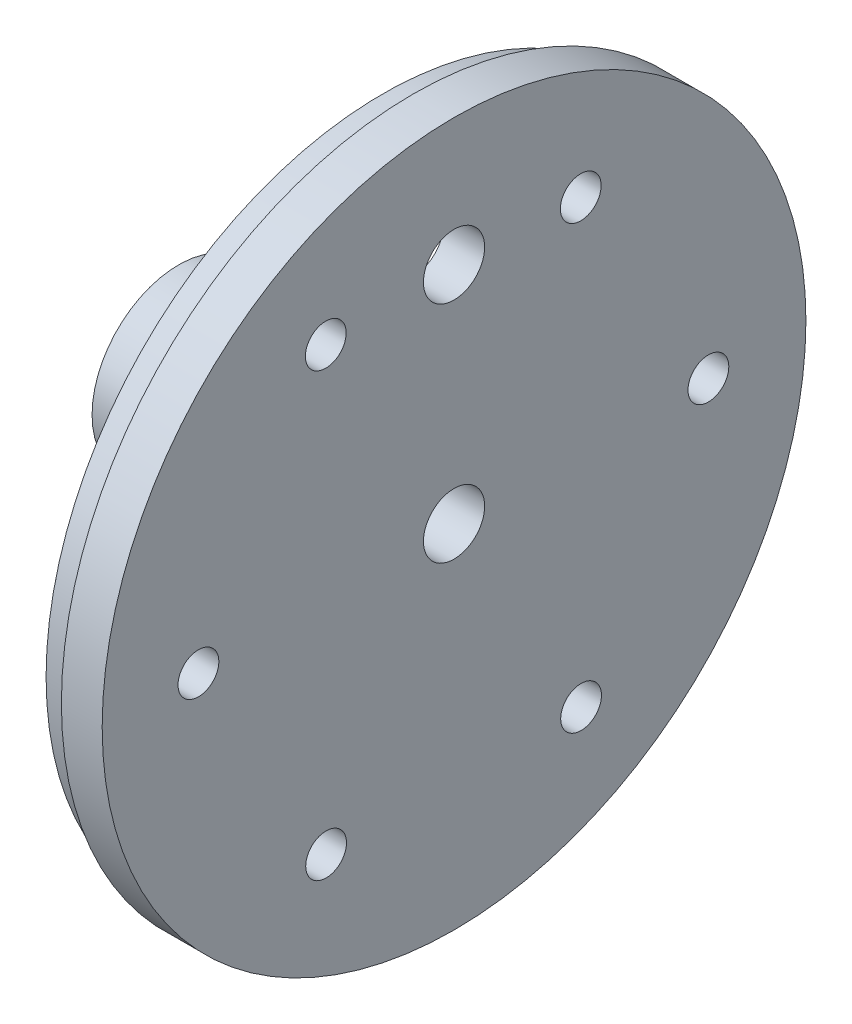
ISO-10303-21;
HEADER;
FILE_DESCRIPTION(('STEP AP214'),'2;1');
FILE_NAME('part.step','',(''),(''),'','','');
FILE_SCHEMA(('AUTOMOTIVE_DESIGN { 1 0 10303 214 1 1 1 1 }'));
ENDSEC;
DATA;
#1=APPLICATION_CONTEXT('core data for automotive mechanical design processes');
#2=APPLICATION_PROTOCOL_DEFINITION('international standard','automotive_design',2000,#1);
#3=PRODUCT_CONTEXT('',#1,'mechanical');
#4=PRODUCT('Part','Part','',(#3));
#5=PRODUCT_RELATED_PRODUCT_CATEGORY('part','',(#4));
#6=PRODUCT_DEFINITION_FORMATION('','',#4);
#7=PRODUCT_DEFINITION_CONTEXT('part definition',#1,'design');
#8=PRODUCT_DEFINITION('design','',#6,#7);
#9=PRODUCT_DEFINITION_SHAPE('','',#8);
#10=(LENGTH_UNIT() NAMED_UNIT(*) SI_UNIT(.MILLI.,.METRE.));
#11=(NAMED_UNIT(*) PLANE_ANGLE_UNIT() SI_UNIT($,.RADIAN.));
#12=(NAMED_UNIT(*) SI_UNIT($,.STERADIAN.) SOLID_ANGLE_UNIT());
#13=UNCERTAINTY_MEASURE_WITH_UNIT(LENGTH_MEASURE(1.E-05),#10,'distance_accuracy_value','');
#14=(GEOMETRIC_REPRESENTATION_CONTEXT(3) GLOBAL_UNCERTAINTY_ASSIGNED_CONTEXT((#13)) GLOBAL_UNIT_ASSIGNED_CONTEXT((#10,
#11,#12)) REPRESENTATION_CONTEXT('',''));
#15=CARTESIAN_POINT('',(0.,0.,0.));
#16=DIRECTION('',(0.,0.,1.));
#17=DIRECTION('',(1.,0.,0.));
#18=AXIS2_PLACEMENT_3D('',#15,#16,#17);
#19=CARTESIAN_POINT('',(-2.,0.,0.));
#20=DIRECTION('',(1.,0.,0.));
#21=DIRECTION('',(0.,0.,-1.));
#22=AXIS2_PLACEMENT_3D('',#19,#20,#21);
#23=PLANE('',#22);
#24=CARTESIAN_POINT('',(-2.,-0.124876413791305,-24.9389150603745));
#25=DIRECTION('',(-1.,0.,0.));
#26=DIRECTION('',(0.,0.,1.));
#27=AXIS2_PLACEMENT_3D('',#24,#25,#26);
#28=CIRCLE('',#27,2.);
#29=CARTESIAN_POINT('',(-2.,-0.124876413791305,-22.9389150603745));
#30=VERTEX_POINT('',#29);
#31=EDGE_CURVE('E377',#30,#30,#28,.T.);
#32=ORIENTED_EDGE('',*,*,#31,.F.);
#33=EDGE_LOOP('',(#32));
#34=FACE_BOUND('',#33,.T.);
#35=CARTESIAN_POINT('',(-2.,-21.7850486057935,-12.4554483698749));
#36=DIRECTION('',(-1.,0.,0.));
#37=DIRECTION('',(0.,0.,1.));
#38=AXIS2_PLACEMENT_3D('',#35,#36,#37);
#39=CIRCLE('',#38,2.);
#40=CARTESIAN_POINT('',(-2.,-21.7850486057935,-10.4554483698749));
#41=VERTEX_POINT('',#40);
#42=EDGE_CURVE('E375',#41,#41,#39,.T.);
#43=ORIENTED_EDGE('',*,*,#42,.F.);
#44=EDGE_LOOP('',(#43));
#45=FACE_BOUND('',#44,.T.);
#46=CARTESIAN_POINT('',(-2.,-21.8041354205251,12.5445443439941));
#47=DIRECTION('',(-1.,0.,0.));
#48=DIRECTION('',(0.,0.,1.));
#49=AXIS2_PLACEMENT_3D('',#46,#47,#48);
#50=CIRCLE('',#49,2.);
#51=CARTESIAN_POINT('',(-2.,-21.8041354205251,14.5445443439941));
#52=VERTEX_POINT('',#51);
#53=EDGE_CURVE('E370',#52,#52,#50,.T.);
#54=ORIENTED_EDGE('',*,*,#53,.F.);
#55=EDGE_LOOP('',(#54));
#56=FACE_BOUND('',#55,.T.);
#57=CARTESIAN_POINT('',(-2.,-0.163050043254486,25.0610703673635));
#58=DIRECTION('',(-1.,0.,0.));
#59=DIRECTION('',(0.,0.,1.));
#60=AXIS2_PLACEMENT_3D('',#57,#58,#59);
#61=CIRCLE('',#60,2.);
#62=CARTESIAN_POINT('',(-2.,-0.163050043254486,27.0610703673635));
#63=VERTEX_POINT('',#62);
#64=EDGE_CURVE('E366',#63,#63,#61,.T.);
#65=ORIENTED_EDGE('',*,*,#64,.F.);
#66=EDGE_LOOP('',(#65));
#67=FACE_BOUND('',#66,.T.);
#68=CARTESIAN_POINT('',(-2.,21.4971221487477,12.5776036768639));
#69=DIRECTION('',(-1.,0.,0.));
#70=DIRECTION('',(0.,0.,1.));
#71=AXIS2_PLACEMENT_3D('',#68,#69,#70);
#72=CIRCLE('',#71,2.);
#73=CARTESIAN_POINT('',(-2.,21.4971221487477,14.5776036768639));
#74=VERTEX_POINT('',#73);
#75=EDGE_CURVE('E364',#74,#74,#72,.T.);
#76=ORIENTED_EDGE('',*,*,#75,.F.);
#77=EDGE_LOOP('',(#76));
#78=FACE_BOUND('',#77,.T.);
#79=CARTESIAN_POINT('',(-2.,21.5162089634793,-12.4223890370051));
#80=DIRECTION('',(-1.,0.,0.));
#81=DIRECTION('',(0.,0.,1.));
#82=AXIS2_PLACEMENT_3D('',#79,#80,#81);
#83=CIRCLE('',#82,2.);
#84=CARTESIAN_POINT('',(-2.,21.5162089634793,-10.4223890370051));
#85=VERTEX_POINT('',#84);
#86=EDGE_CURVE('E61',#85,#85,#83,.T.);
#87=ORIENTED_EDGE('',*,*,#86,.F.);
#88=EDGE_LOOP('',(#87));
#89=FACE_BOUND('',#88,.T.);
#90=CARTESIAN_POINT('',(-2.,22.,0.));
#91=DIRECTION('',(-1.,0.,0.));
#92=DIRECTION('',(0.,0.,1.));
#93=AXIS2_PLACEMENT_3D('',#90,#91,#92);
#94=CIRCLE('',#93,3.);
#95=CARTESIAN_POINT('',(-2.,22.,3.));
#96=VERTEX_POINT('',#95);
#97=EDGE_CURVE('E56',#96,#96,#94,.T.);
#98=ORIENTED_EDGE('',*,*,#97,.F.);
#99=EDGE_LOOP('',(#98));
#100=FACE_BOUND('',#99,.T.);
#101=CARTESIAN_POINT('',(-2.,0.,0.));
#102=DIRECTION('',(-1.,0.,0.));
#103=DIRECTION('',(0.,0.,1.));
#104=AXIS2_PLACEMENT_3D('',#101,#102,#103);
#105=CIRCLE('',#104,8.49);
#106=CARTESIAN_POINT('',(-2.,0.,8.49));
#107=VERTEX_POINT('',#106);
#108=EDGE_CURVE('E41',#107,#107,#105,.T.);
#109=ORIENTED_EDGE('',*,*,#108,.F.);
#110=EDGE_LOOP('',(#109));
#111=FACE_BOUND('',#110,.T.);
#112=CARTESIAN_POINT('',(-2.,0.,0.));
#113=DIRECTION('',(-1.,0.,0.));
#114=DIRECTION('',(0.,0.,1.));
#115=AXIS2_PLACEMENT_3D('',#112,#113,#114);
#116=CIRCLE('',#115,30.);
#117=CARTESIAN_POINT('',(-2.,0.,30.));
#118=VERTEX_POINT('',#117);
#119=EDGE_CURVE('E55',#118,#118,#116,.T.);
#120=ORIENTED_EDGE('',*,*,#119,.T.);
#121=EDGE_LOOP('',(#120));
#122=FACE_BOUND('',#121,.T.);
#123=ADVANCED_FACE('F33',(#34,#45,#56,#67,#78,#89,#100,#111,#122),#23,.F.);
#124=CARTESIAN_POINT('',(2.,0.,0.));
#125=DIRECTION('',(-1.,0.,0.));
#126=DIRECTION('',(0.,0.,1.));
#127=AXIS2_PLACEMENT_3D('',#124,#125,#126);
#128=CYLINDRICAL_SURFACE('',#127,34.5);
#129=CARTESIAN_POINT('',(2.,0.,0.));
#130=DIRECTION('',(1.,0.,0.));
#131=DIRECTION('',(0.,0.,-1.));
#132=AXIS2_PLACEMENT_3D('',#129,#130,#131);
#133=CIRCLE('',#132,34.5);
#134=CARTESIAN_POINT('',(2.,0.,-34.5));
#135=VERTEX_POINT('',#134);
#136=EDGE_CURVE('E46',#135,#135,#133,.T.);
#137=ORIENTED_EDGE('',*,*,#136,.F.);
#138=EDGE_LOOP('',(#137));
#139=FACE_BOUND('',#138,.T.);
#140=CARTESIAN_POINT('',(-2.,0.,0.));
#141=DIRECTION('',(1.,0.,0.));
#142=DIRECTION('',(0.,0.,-1.));
#143=AXIS2_PLACEMENT_3D('',#140,#141,#142);
#144=CIRCLE('',#143,34.5);
#145=CARTESIAN_POINT('',(-2.,0.,-34.5));
#146=VERTEX_POINT('',#145);
#147=EDGE_CURVE('E50',#146,#146,#144,.T.);
#148=ORIENTED_EDGE('',*,*,#147,.T.);
#149=EDGE_LOOP('',(#148));
#150=FACE_BOUND('',#149,.T.);
#151=ADVANCED_FACE('F35',(#139,#150),#128,.T.);
#152=CARTESIAN_POINT('',(2.,0.,0.));
#153=DIRECTION('',(1.,0.,0.));
#154=DIRECTION('',(0.,0.,-1.));
#155=AXIS2_PLACEMENT_3D('',#152,#153,#154);
#156=PLANE('',#155);
#157=CARTESIAN_POINT('',(2.,-0.124876413791305,-24.9389150603745));
#158=DIRECTION('',(1.,0.,0.));
#159=DIRECTION('',(0.,0.,-1.));
#160=AXIS2_PLACEMENT_3D('',#157,#158,#159);
#161=CIRCLE('',#160,2.);
#162=CARTESIAN_POINT('',(2.,-0.124876413791305,-26.9389150603745));
#163=VERTEX_POINT('',#162);
#164=EDGE_CURVE('E37',#163,#163,#161,.T.);
#165=ORIENTED_EDGE('',*,*,#164,.F.);
#166=EDGE_LOOP('',(#165));
#167=FACE_BOUND('',#166,.T.);
#168=CARTESIAN_POINT('',(2.,-21.7850486057935,-12.4554483698749));
#169=DIRECTION('',(1.,0.,0.));
#170=DIRECTION('',(0.,0.,-1.));
#171=AXIS2_PLACEMENT_3D('',#168,#169,#170);
#172=CIRCLE('',#171,2.);
#173=CARTESIAN_POINT('',(2.,-21.7850486057935,-14.4554483698749));
#174=VERTEX_POINT('',#173);
#175=EDGE_CURVE('E69',#174,#174,#172,.T.);
#176=ORIENTED_EDGE('',*,*,#175,.F.);
#177=EDGE_LOOP('',(#176));
#178=FACE_BOUND('',#177,.T.);
#179=CARTESIAN_POINT('',(2.,-21.8041354205251,12.5445443439941));
#180=DIRECTION('',(1.,0.,0.));
#181=DIRECTION('',(0.,0.,-1.));
#182=AXIS2_PLACEMENT_3D('',#179,#180,#181);
#183=CIRCLE('',#182,2.);
#184=CARTESIAN_POINT('',(2.,-21.8041354205251,10.5445443439941));
#185=VERTEX_POINT('',#184);
#186=EDGE_CURVE('E67',#185,#185,#183,.T.);
#187=ORIENTED_EDGE('',*,*,#186,.F.);
#188=EDGE_LOOP('',(#187));
#189=FACE_BOUND('',#188,.T.);
#190=CARTESIAN_POINT('',(2.,-0.163050043254486,25.0610703673635));
#191=DIRECTION('',(1.,0.,0.));
#192=DIRECTION('',(0.,0.,-1.));
#193=AXIS2_PLACEMENT_3D('',#190,#191,#192);
#194=CIRCLE('',#193,2.);
#195=CARTESIAN_POINT('',(2.,-0.163050043254486,23.0610703673635));
#196=VERTEX_POINT('',#195);
#197=EDGE_CURVE('E64',#196,#196,#194,.T.);
#198=ORIENTED_EDGE('',*,*,#197,.F.);
#199=EDGE_LOOP('',(#198));
#200=FACE_BOUND('',#199,.T.);
#201=CARTESIAN_POINT('',(2.,21.4971221487477,12.5776036768639));
#202=DIRECTION('',(1.,0.,0.));
#203=DIRECTION('',(0.,0.,-1.));
#204=AXIS2_PLACEMENT_3D('',#201,#202,#203);
#205=CIRCLE('',#204,2.);
#206=CARTESIAN_POINT('',(2.,21.4971221487477,10.5776036768639));
#207=VERTEX_POINT('',#206);
#208=EDGE_CURVE('E60',#207,#207,#205,.T.);
#209=ORIENTED_EDGE('',*,*,#208,.F.);
#210=EDGE_LOOP('',(#209));
#211=FACE_BOUND('',#210,.T.);
#212=CARTESIAN_POINT('',(2.,21.5162089634793,-12.4223890370051));
#213=DIRECTION('',(1.,0.,0.));
#214=DIRECTION('',(0.,0.,-1.));
#215=AXIS2_PLACEMENT_3D('',#212,#213,#214);
#216=CIRCLE('',#215,2.);
#217=CARTESIAN_POINT('',(2.,21.5162089634793,-14.4223890370051));
#218=VERTEX_POINT('',#217);
#219=EDGE_CURVE('E57',#218,#218,#216,.T.);
#220=ORIENTED_EDGE('',*,*,#219,.F.);
#221=EDGE_LOOP('',(#220));
#222=FACE_BOUND('',#221,.T.);
#223=CARTESIAN_POINT('',(2.,22.,0.));
#224=DIRECTION('',(1.,0.,0.));
#225=DIRECTION('',(0.,0.,-1.));
#226=AXIS2_PLACEMENT_3D('',#223,#224,#225);
#227=CIRCLE('',#226,3.);
#228=CARTESIAN_POINT('',(2.,22.,-3.));
#229=VERTEX_POINT('',#228);
#230=EDGE_CURVE('E52',#229,#229,#227,.T.);
#231=ORIENTED_EDGE('',*,*,#230,.F.);
#232=EDGE_LOOP('',(#231));
#233=FACE_BOUND('',#232,.T.);
#234=CARTESIAN_POINT('',(2.,0.,0.));
#235=DIRECTION('',(1.,0.,0.));
#236=DIRECTION('',(0.,0.,-1.));
#237=AXIS2_PLACEMENT_3D('',#234,#235,#236);
#238=CIRCLE('',#237,3.);
#239=CARTESIAN_POINT('',(2.,0.,-3.));
#240=VERTEX_POINT('',#239);
#241=EDGE_CURVE('E180',#240,#240,#238,.T.);
#242=ORIENTED_EDGE('',*,*,#241,.F.);
#243=EDGE_LOOP('',(#242));
#244=FACE_BOUND('',#243,.T.);
#245=ORIENTED_EDGE('',*,*,#136,.T.);
#246=EDGE_LOOP('',(#245));
#247=FACE_BOUND('',#246,.T.);
#248=ADVANCED_FACE('F157',(#167,#178,#189,#200,#211,#222,#233,#244,#247),#156,.T.);
#249=CARTESIAN_POINT('',(-2.,0.,0.));
#250=DIRECTION('',(1.,0.,0.));
#251=DIRECTION('',(0.,0.,-1.));
#252=AXIS2_PLACEMENT_3D('',#249,#250,#251);
#253=CIRCLE('',#252,33.);
#254=CARTESIAN_POINT('',(-2.,0.,-33.));
#255=VERTEX_POINT('',#254);
#256=EDGE_CURVE('E10',#255,#255,#253,.F.);
#257=ORIENTED_EDGE('',*,*,#256,.F.);
#258=EDGE_LOOP('',(#257));
#259=FACE_BOUND('',#258,.T.);
#260=ORIENTED_EDGE('',*,*,#147,.F.);
#261=EDGE_LOOP('',(#260));
#262=FACE_BOUND('',#261,.T.);
#263=ADVANCED_FACE('F153',(#259,#262),#23,.F.);
#264=CARTESIAN_POINT('',(-25.,0.,0.));
#265=DIRECTION('',(1.,0.,0.));
#266=DIRECTION('',(0.,0.,-1.));
#267=AXIS2_PLACEMENT_3D('',#264,#265,#266);
#268=CYLINDRICAL_SURFACE('',#267,8.49);
#269=CARTESIAN_POINT('',(-18.,0.,-8.49));
#270=CARTESIAN_POINT('',(-18.0000032805128,-0.083558587392723,-8.48999852385832));
#271=CARTESIAN_POINT('',(-18.0070056283511,-0.167160889848505,-8.48875362744455));
#272=CARTESIAN_POINT('',(-18.034815386016,-0.332015537772016,-8.48390741685094));
#273=CARTESIAN_POINT('',(-18.0556350039666,-0.413265738749538,-8.48030401887723));
#274=CARTESIAN_POINT('',(-18.1104267707101,-0.571007669932503,-8.47114446961175));
#275=CARTESIAN_POINT('',(-18.1443876357958,-0.647503417316507,-8.46558999398551));
#276=CARTESIAN_POINT('',(-18.2244671419778,-0.793702612111237,-8.45313706154174));
#277=CARTESIAN_POINT('',(-18.2705845833805,-0.863406728837095,-8.44623873736184));
#278=CARTESIAN_POINT('',(-18.3741920196845,-0.994797613294816,-8.43177883422587));
#279=CARTESIAN_POINT('',(-18.431786639101,-1.05640125970589,-8.42421153905372));
#280=CARTESIAN_POINT('',(-18.5564883829598,-1.1691239846387,-8.40930970258169));
#281=CARTESIAN_POINT('',(-18.6235961448428,-1.22024236001897,-8.40197517691918));
#282=CARTESIAN_POINT('',(-18.7659979557778,-1.31088252198505,-8.38831389267499));
#283=CARTESIAN_POINT('',(-18.8413457983025,-1.35032100510769,-8.38199451381391));
#284=CARTESIAN_POINT('',(-18.9977274956205,-1.41594889917383,-8.37115894533931));
#285=CARTESIAN_POINT('',(-19.0787609166558,-1.44213931957511,-8.36664261834483));
#286=CARTESIAN_POINT('',(-19.2433284423338,-1.48026344709083,-8.35998172820928));
#287=CARTESIAN_POINT('',(-19.3268281520926,-1.49234135467577,-8.35781319263357));
#288=CARTESIAN_POINT('',(-19.4946949239451,-1.50234493737355,-8.356021018373));
#289=CARTESIAN_POINT('',(-19.5790619165147,-1.50027173818741,-8.35639717726119));
#290=CARTESIAN_POINT('',(-19.7452318974297,-1.48214916646832,-8.35963003129627));
#291=CARTESIAN_POINT('',(-19.8270532975483,-1.46626270174515,-8.36245781193004));
#292=CARTESIAN_POINT('',(-19.9868508653649,-1.42122063390474,-8.37022995776264));
#293=CARTESIAN_POINT('',(-20.0648268862647,-1.39206452465003,-8.37517440369597));
#294=CARTESIAN_POINT('',(-20.2152027823378,-1.32114837723655,-8.38665353108068));
#295=CARTESIAN_POINT('',(-20.2875705006457,-1.27932156502506,-8.39319660097569));
#296=CARTESIAN_POINT('',(-20.4243218655896,-1.1842986424468,-8.40713004692969));
#297=CARTESIAN_POINT('',(-20.4887047893454,-1.13110150388614,-8.41452049958763));
#298=CARTESIAN_POINT('',(-20.6086011554741,-1.01396471939969,-8.42944255374328));
#299=CARTESIAN_POINT('',(-20.6639782604456,-0.949885499172665,-8.43697468558423));
#300=CARTESIAN_POINT('',(-20.7632158605754,-0.813273228475772,-8.45123632989513));
#301=CARTESIAN_POINT('',(-20.8070762634769,-0.740740110290906,-8.45796583593524));
#302=CARTESIAN_POINT('',(-20.8820513918003,-0.589144267837167,-8.46987535933659));
#303=CARTESIAN_POINT('',(-20.9131530783321,-0.510074962479577,-8.4750537901111));
#304=CARTESIAN_POINT('',(-20.9615961273376,-0.347722802030305,-8.48326520080255));
#305=CARTESIAN_POINT('',(-20.9789387853786,-0.264440344440023,-8.48629838271586));
#306=CARTESIAN_POINT('',(-20.9991843571915,-0.0972000575819082,-8.48985010449396));
#307=CARTESIAN_POINT('',(-21.0022742639677,-0.0132655332674427,-8.49040120642842));
#308=CARTESIAN_POINT('',(-20.9944265792887,0.153921340374261,-8.48901621420096));
#309=CARTESIAN_POINT('',(-20.983489596914,0.237173719163893,-8.48708022803427));
#310=CARTESIAN_POINT('',(-20.9480541076337,0.400048237916095,-8.48095879900839));
#311=CARTESIAN_POINT('',(-20.9236491311422,0.479691360529354,-8.4767888758175));
#312=CARTESIAN_POINT('',(-20.8620708299674,0.633755673871689,-8.46666519068105));
#313=CARTESIAN_POINT('',(-20.8248967164024,0.708176541625932,-8.46071131852544));
#314=CARTESIAN_POINT('',(-20.7384138383521,0.850489447284243,-8.44759909229656));
#315=CARTESIAN_POINT('',(-20.6889894529945,0.918310165094663,-8.44042948021944));
#316=CARTESIAN_POINT('',(-20.5795668368953,1.0447620087645,-8.42571256957737));
#317=CARTESIAN_POINT('',(-20.5195677365515,1.10339237811407,-8.41816523998773));
#318=CARTESIAN_POINT('',(-20.3898564083307,1.2105005260445,-8.40343694892904));
#319=CARTESIAN_POINT('',(-20.320038651385,1.25885135641409,-8.39626131357577));
#320=CARTESIAN_POINT('',(-20.1731620999772,1.34313855828378,-8.38319185064413));
#321=CARTESIAN_POINT('',(-20.0961035547785,1.37907535693674,-8.3772979789643));
#322=CARTESIAN_POINT('',(-19.9372725288831,1.43732909241661,-8.36750019661098));
#323=CARTESIAN_POINT('',(-19.8555229385442,1.45970687901037,-8.36358740849482));
#324=CARTESIAN_POINT('',(-19.6893495795725,1.49039717666408,-8.3581734461324));
#325=CARTESIAN_POINT('',(-19.6049260761641,1.49871107829245,-8.35667203346183));
#326=CARTESIAN_POINT('',(-19.4370707883935,1.50099518248986,-8.35626195125692));
#327=CARTESIAN_POINT('',(-19.3536417473766,1.49516539121163,-8.35731712866818));
#328=CARTESIAN_POINT('',(-19.1889721601938,1.46976259483725,-8.3618216665186));
#329=CARTESIAN_POINT('',(-19.1077316042861,1.45018965092784,-8.36527101629851));
#330=CARTESIAN_POINT('',(-18.9498365904706,1.39793645312556,-8.37416080542115));
#331=CARTESIAN_POINT('',(-18.8731755702615,1.36527549803899,-8.37959831211632));
#332=CARTESIAN_POINT('',(-18.7263889740944,1.28779452265732,-8.3918542031944));
#333=CARTESIAN_POINT('',(-18.6562637876191,1.24297377835913,-8.39867266979458));
#334=CARTESIAN_POINT('',(-18.5235329214797,1.14174029211935,-8.4130357224566));
#335=CARTESIAN_POINT('',(-18.4610398164985,1.08518112679867,-8.42058876911915));
#336=CARTESIAN_POINT('',(-18.3463638968626,0.96238365214064,-8.43550444587119));
#337=CARTESIAN_POINT('',(-18.2941834580073,0.896143118540139,-8.44286703174419));
#338=CARTESIAN_POINT('',(-18.2012348774942,0.755241496258381,-8.45663973882464));
#339=CARTESIAN_POINT('',(-18.16055970069,0.68051828989081,-8.46304191526457));
#340=CARTESIAN_POINT('',(-18.0924035710447,0.525213535399696,-8.47409511595945));
#341=CARTESIAN_POINT('',(-18.0649098239962,0.444637755775457,-8.47874783732646));
#342=CARTESIAN_POINT('',(-18.0296860427037,0.30315269068652,-8.48479349629451));
#343=CARTESIAN_POINT('',(-18.0185721560665,0.243086509754911,-8.48673522647389));
#344=CARTESIAN_POINT('',(-18.0037280136679,0.122021311093022,-8.48933900402081));
#345=CARTESIAN_POINT('',(-17.9999976042621,0.0610223128005892,-8.49000107801702));
#346=CARTESIAN_POINT('',(-18.,0.,-8.49));
#347=B_SPLINE_CURVE_WITH_KNOTS('',3,(#269,#270,#271,#272,#273,#274,#275,#276,#277,#278,#279,
#280,#281,#282,#283,#284,#285,#286,#287,#288,#289,#290,#291,#292,#293,#294,#295,#296,#297,#298,
#299,#300,#301,#302,#303,#304,#305,#306,#307,#308,#309,#310,#311,#312,#313,#314,#315,#316,#317,
#318,#319,#320,#321,#322,#323,#324,#325,#326,#327,#328,#329,#330,#331,#332,#333,#334,#335,#336,
#337,#338,#339,#340,#341,#342,#343,#344,#345,#346),.UNSPECIFIED.,.T.,.F.,(4,2,2,2,2,2,2,2,2,2,2,
2,2,2,2,2,2,2,2,2,2,2,2,2,2,2,2,2,2,2,2,2,2,2,2,2,2,2,4),(0.,0.250452658293494,
0.501126896889828,0.751586370438257,1.00202113618982,1.25485286918272,1.50770155151333,
1.76231242200501,2.01690388908203,2.26887056089622,2.52081718934295,2.76983216048266,
3.01885663047292,3.26921697858819,3.51959997583106,3.77347767172481,4.02735740129706,
4.28149594314485,4.53561055215092,4.78638156774398,5.03714169463759,5.28618190578392,
5.53523750548589,5.78673977873597,6.03826274370916,6.29273151695341,6.54719153334106,
6.80050096565918,7.05378535051039,7.30350896500471,7.55323146769638,7.80258709141638,
8.05195756521942,8.30464893844911,8.55739845823314,8.81213542626984,9.06662463748622,
9.24953245073303,9.43243645776577),.UNSPECIFIED.);
#348=CARTESIAN_POINT('',(-18.,0.,-8.49));
#349=VERTEX_POINT('',#348);
#350=EDGE_CURVE('E99',#349,#349,#347,.T.);
#351=ORIENTED_EDGE('',*,*,#350,.F.);
#352=EDGE_LOOP('',(#351));
#353=FACE_BOUND('',#352,.T.);
#354=CARTESIAN_POINT('',(-19.5,8.35644062983756,1.5));
#355=CARTESIAN_POINT('',(-19.4164528861838,8.35644219511906,1.49999671011188));
#356=CARTESIAN_POINT('',(-19.3328620301014,8.35770716889425,1.49299622019491));
#357=CARTESIAN_POINT('',(-19.1680311546519,8.36262499235056,1.4651945113278));
#358=CARTESIAN_POINT('',(-19.0867932890014,8.36627996171475,1.44438104142434));
#359=CARTESIAN_POINT('',(-18.9290774701165,8.37555119152216,1.38960725168995));
#360=CARTESIAN_POINT('',(-18.8525953952402,8.38116572497631,1.35565850529604));
#361=CARTESIAN_POINT('',(-18.7064192119726,8.39372142531193,1.2756075583092));
#362=CARTESIAN_POINT('',(-18.6367244503438,8.40066246433449,1.22950652888547));
#363=CARTESIAN_POINT('',(-18.5053234268625,8.41517487832421,1.12591584933334));
#364=CARTESIAN_POINT('',(-18.4437031505103,8.42275181693303,1.06831789355467));
#365=CARTESIAN_POINT('',(-18.3309482080793,8.43763301196994,0.943602438923493));
#366=CARTESIAN_POINT('',(-18.2798141940476,8.4449372514182,0.876484348537474));
#367=CARTESIAN_POINT('',(-18.1891573358997,8.4585092886306,0.734073067597437));
#368=CARTESIAN_POINT('',(-18.1497150157415,8.4647697743356,0.658727860297577));
#369=CARTESIAN_POINT('',(-18.0840793065291,8.47548683098104,0.502351873699896));
#370=CARTESIAN_POINT('',(-18.0578849501905,8.47994353361783,0.421321509989143));
#371=CARTESIAN_POINT('',(-18.0197531010197,8.48651158764986,0.256765071939197));
#372=CARTESIAN_POINT('',(-18.0076708947683,8.48864672959164,0.173273496479645));
#373=CARTESIAN_POINT('',(-17.9976558941528,8.49041295112777,0.00542277938344639));
#374=CARTESIAN_POINT('',(-17.9997220245342,8.49004422101302,-0.0789362958378573));
#375=CARTESIAN_POINT('',(-18.0178330637276,8.48686296433974,-0.245136533836612));
#376=CARTESIAN_POINT('',(-18.0337221961292,8.4840776718389,-0.326995267946358));
#377=CARTESIAN_POINT('',(-18.0787824091619,8.47640668608895,-0.486866111888764));
#378=CARTESIAN_POINT('',(-18.1079539325045,8.47152092282995,-0.564878093410363));
#379=CARTESIAN_POINT('',(-18.1789026757869,8.46015197412107,-0.715298893931947));
#380=CARTESIAN_POINT('',(-18.2207431873496,8.45366079890782,-0.787677231762884));
#381=CARTESIAN_POINT('',(-18.3157957193783,8.43980067472706,-0.924444096349375));
#382=CARTESIAN_POINT('',(-18.3690087708201,8.43243164620471,-0.988831897887012));
#383=CARTESIAN_POINT('',(-18.4861572872131,8.41751530432448,-1.10871157700322));
#384=CARTESIAN_POINT('',(-18.5502289720833,8.40996692984022,-1.16407028826372));
#385=CARTESIAN_POINT('',(-18.6868194612777,8.395639224986,-1.26327430484317));
#386=CARTESIAN_POINT('',(-18.7593383633969,8.38885990352131,-1.30711947684847));
#387=CARTESIAN_POINT('',(-18.9109294627206,8.37683685104292,-1.38208344532902));
#388=CARTESIAN_POINT('',(-18.9900105308265,8.37159524360489,-1.41318466575014));
#389=CARTESIAN_POINT('',(-19.152388387236,8.36327492708122,-1.46162322080302));
#390=CARTESIAN_POINT('',(-19.2356847542768,8.36019600232014,-1.47896192793597));
#391=CARTESIAN_POINT('',(-19.4029328926418,8.35659184421866,-1.49919254675275));
#392=CARTESIAN_POINT('',(-19.4868609146319,8.3560329355192,-1.50227498164156));
#393=CARTESIAN_POINT('',(-19.6540330244773,8.35744220047703,-1.49441467495769));
#394=CARTESIAN_POINT('',(-19.737277142019,8.35941026385617,-1.48347254542311));
#395=CARTESIAN_POINT('',(-19.9001034087853,8.36562048965433,-1.44803668719108));
#396=CARTESIAN_POINT('',(-19.9797076427541,8.36984614478942,-1.42364128627186));
#397=CARTESIAN_POINT('',(-20.1336983843831,8.38008140696682,-1.36209506501687));
#398=CARTESIAN_POINT('',(-20.208084545243,8.38609113244227,-1.32494339784765));
#399=CARTESIAN_POINT('',(-20.3503715263823,8.39929491167651,-1.23849480193821));
#400=CARTESIAN_POINT('',(-20.4181975653578,8.4065005384358,-1.18907658975241));
#401=CARTESIAN_POINT('',(-20.5446629929712,8.42125099209766,-1.07966280222755));
#402=CARTESIAN_POINT('',(-20.6033016513368,8.42879584590289,-1.01966638686946));
#403=CARTESIAN_POINT('',(-20.7104309862301,8.44348195412094,-0.889951959095793));
#404=CARTESIAN_POINT('',(-20.7587940978803,8.45061741297112,-0.8201278351419));
#405=CARTESIAN_POINT('',(-20.843102818974,8.46358571837854,-0.673234958731794));
#406=CARTESIAN_POINT('',(-20.8790488671929,8.46941861096132,-0.59616646238871));
#407=CARTESIAN_POINT('',(-20.9373080792174,8.47909950944599,-0.43733908802082));
#408=CARTESIAN_POINT('',(-20.9596860731176,8.48295694041449,-0.355604589599884));
#409=CARTESIAN_POINT('',(-20.990381886962,8.48829230559771,-0.189463324686968));
#410=CARTESIAN_POINT('',(-20.9987010135621,8.4897704609459,-0.10505680728008));
#411=CARTESIAN_POINT('',(-21.0010016521065,8.49017700824173,0.0628050016629258));
#412=CARTESIAN_POINT('',(-20.9951765808511,8.4891397971603,0.146257621476289));
#413=CARTESIAN_POINT('',(-20.9697749820485,8.48470295486834,0.310975611854871));
#414=CARTESIAN_POINT('',(-20.9501985558377,8.48130334106684,0.392240998533676));
#415=CARTESIAN_POINT('',(-20.8979276358968,8.47252285803627,0.550190541131629));
#416=CARTESIAN_POINT('',(-20.8652515334924,8.46714476736334,0.626880947415654));
#417=CARTESIAN_POINT('',(-20.787731078628,8.45499211729699,0.773720087826468));
#418=CARTESIAN_POINT('',(-20.7428860359632,8.44821747869863,0.843868450594676));
#419=CARTESIAN_POINT('',(-20.641624224819,8.43391179896679,0.97660180292825));
#420=CARTESIAN_POINT('',(-20.585066678623,8.42637218544403,1.03907848188969));
#421=CARTESIAN_POINT('',(-20.4622794076298,8.41144317169372,1.15372201137673));
#422=CARTESIAN_POINT('',(-20.3960474183253,8.40405380709767,1.20588644135696));
#423=CARTESIAN_POINT('',(-20.2551542533813,8.39019719520816,1.2988158410072));
#424=CARTESIAN_POINT('',(-20.1804293823242,8.38373786854403,1.33948544438459));
#425=CARTESIAN_POINT('',(-20.0251214768099,8.3725670011945,1.40763070663389));
#426=CARTESIAN_POINT('',(-19.9445442335325,8.36785376012036,1.43511920936516));
#427=CARTESIAN_POINT('',(-19.8030728182368,8.36172505144718,1.47032969787541));
#428=CARTESIAN_POINT('',(-19.7430226432339,8.3597547569844,1.48143765048198));
#429=CARTESIAN_POINT('',(-19.6219894061334,8.35711198903266,1.49627392114901));
#430=CARTESIAN_POINT('',(-19.561006364681,8.3564394868641,1.50000240228663));
#431=CARTESIAN_POINT('',(-19.5,8.35644062983756,1.5));
#432=B_SPLINE_CURVE_WITH_KNOTS('',3,(#354,#355,#356,#357,#358,#359,#360,#361,#362,#363,#364,
#365,#366,#367,#368,#369,#370,#371,#372,#373,#374,#375,#376,#377,#378,#379,#380,#381,#382,#383,
#384,#385,#386,#387,#388,#389,#390,#391,#392,#393,#394,#395,#396,#397,#398,#399,#400,#401,#402,
#403,#404,#405,#406,#407,#408,#409,#410,#411,#412,#413,#414,#415,#416,#417,#418,#419,#420,#421,
#422,#423,#424,#425,#426,#427,#428,#429,#430,#431),.UNSPECIFIED.,.T.,.F.,(4,2,2,2,2,2,2,2,2,2,2,
2,2,2,2,2,2,2,2,2,2,2,2,2,2,2,2,2,2,2,2,2,2,2,2,2,2,2,4),(0.,0.250418177641614,0.50105875252592,
0.751478990112638,1.00187510241301,1.25475196880581,1.5076445545899,1.76224043934108,
2.01681773238946,2.268760876488,2.52068487346143,2.76980609410081,3.0189356187355,
3.26933087307476,3.5197488365938,3.77357889446039,4.02741189125979,4.28159379764496,
4.53575035191524,4.78650030886711,5.03723932335409,5.28616955974357,5.5351163247331,
5.78663005632122,6.03816376971119,6.29265802940939,6.54714329525399,6.80040280968889,
7.05363878444244,7.30343139693493,7.55322216867388,7.80266346730326,8.05211891684056,
8.30476756455964,8.55747544506855,8.81222217125442,9.06672016148197,9.24958034164084,
9.43243648077184),.UNSPECIFIED.);
#433=CARTESIAN_POINT('',(-19.5,8.35644062983756,1.5));
#434=VERTEX_POINT('',#433);
#435=EDGE_CURVE('E190',#434,#434,#432,.T.);
#436=ORIENTED_EDGE('',*,*,#435,.F.);
#437=EDGE_LOOP('',(#436));
#438=FACE_BOUND('',#437,.T.);
#439=CARTESIAN_POINT('',(-25.,0.,0.));
#440=DIRECTION('',(-1.,0.,0.));
#441=DIRECTION('',(0.,0.,1.));
#442=AXIS2_PLACEMENT_3D('',#439,#440,#441);
#443=CIRCLE('',#442,8.49);
#444=CARTESIAN_POINT('',(-25.,0.,8.49));
#445=VERTEX_POINT('',#444);
#446=EDGE_CURVE('E177',#445,#445,#443,.T.);
#447=ORIENTED_EDGE('',*,*,#446,.F.);
#448=EDGE_LOOP('',(#447));
#449=FACE_BOUND('',#448,.T.);
#450=ORIENTED_EDGE('',*,*,#108,.T.);
#451=EDGE_LOOP('',(#450));
#452=FACE_BOUND('',#451,.T.);
#453=ADVANCED_FACE('F163',(#353,#438,#449,#452),#268,.T.);
#454=CARTESIAN_POINT('',(-25.,0.,0.));
#455=DIRECTION('',(-1.,0.,0.));
#456=DIRECTION('',(0.,0.,1.));
#457=AXIS2_PLACEMENT_3D('',#454,#455,#456);
#458=PLANE('',#457);
#459=CARTESIAN_POINT('',(-25.,0.,0.));
#460=DIRECTION('',(-1.,0.,0.));
#461=DIRECTION('',(0.,0.,1.));
#462=AXIS2_PLACEMENT_3D('',#459,#460,#461);
#463=CIRCLE('',#462,3.);
#464=CARTESIAN_POINT('',(-25.,0.,3.));
#465=VERTEX_POINT('',#464);
#466=EDGE_CURVE('E185',#465,#465,#463,.T.);
#467=ORIENTED_EDGE('',*,*,#466,.F.);
#468=EDGE_LOOP('',(#467));
#469=FACE_BOUND('',#468,.T.);
#470=ORIENTED_EDGE('',*,*,#446,.T.);
#471=EDGE_LOOP('',(#470));
#472=FACE_BOUND('',#471,.T.);
#473=ADVANCED_FACE('F169',(#469,#472),#458,.T.);
#474=CARTESIAN_POINT('',(5.,0.,0.));
#475=DIRECTION('',(-1.,0.,0.));
#476=DIRECTION('',(0.,0.,1.));
#477=AXIS2_PLACEMENT_3D('',#474,#475,#476);
#478=CYLINDRICAL_SURFACE('',#477,3.);
#479=CARTESIAN_POINT('',(-18.,0.,-3.));
#480=CARTESIAN_POINT('',(-18.0000049534758,0.07885794442685,-2.99999570107562));
#481=CARTESIAN_POINT('',(-18.0062551096816,0.157809899546344,-2.99685736529635));
#482=CARTESIAN_POINT('',(-18.0309793205123,0.313380352903344,-2.98461234055736));
#483=CARTESIAN_POINT('',(-18.0494765894967,0.389994130070444,-2.97549431743379));
#484=CARTESIAN_POINT('',(-18.0977907129249,0.538400317320673,-2.95224419105063));
#485=CARTESIAN_POINT('',(-18.127563576372,0.61021020440872,-2.93813158766306));
#486=CARTESIAN_POINT('',(-18.1973559320475,0.747708925209898,-2.90618664773642));
#487=CARTESIAN_POINT('',(-18.2373746163733,0.813398240985088,-2.88835460450288));
#488=CARTESIAN_POINT('',(-18.3292758742279,0.941261726642863,-2.84934387387093));
#489=CARTESIAN_POINT('',(-18.3817297188595,1.00298281668316,-2.82802798691306));
#490=CARTESIAN_POINT('',(-18.4957822188706,1.11716916730047,-2.78489955370115));
#491=CARTESIAN_POINT('',(-18.5573877776587,1.16962737466015,-2.76308664313552));
#492=CARTESIAN_POINT('',(-18.6937250242851,1.26787800067542,-2.71948426796021));
#493=CARTESIAN_POINT('',(-18.7691041475189,1.31283800332746,-2.69782780455198));
#494=CARTESIAN_POINT('',(-18.9275510039793,1.38925234033604,-2.65928968158481));
#495=CARTESIAN_POINT('',(-19.0106131930841,1.4207163224495,-2.64240461410484));
#496=CARTESIAN_POINT('',(-19.1769976581329,1.46719866328288,-2.61686800556713));
#497=CARTESIAN_POINT('',(-19.2600066781011,1.48308878562066,-2.6077840737557));
#498=CARTESIAN_POINT('',(-19.4279682566692,1.50064048996327,-2.59772834922792));
#499=CARTESIAN_POINT('',(-19.5129188113067,1.50231613255961,-2.59674854014932));
#500=CARTESIAN_POINT('',(-19.6714290364731,1.49203093075844,-2.60266395385873));
#501=CARTESIAN_POINT('',(-19.7451360468346,1.48167683930523,-2.6086314549302));
#502=CARTESIAN_POINT('',(-19.8895828640596,1.4504097735854,-2.62614343100775));
#503=CARTESIAN_POINT('',(-19.960321717958,1.42949343584648,-2.63768968247664));
#504=CARTESIAN_POINT('',(-20.0988436988485,1.37731467057901,-2.66531214619112));
#505=CARTESIAN_POINT('',(-20.1665195981787,1.34582260067399,-2.68148760995998));
#506=CARTESIAN_POINT('',(-20.295951438885,1.273562531502,-2.71655106422106));
#507=CARTESIAN_POINT('',(-20.3577047034001,1.2327903657187,-2.73544027170286));
#508=CARTESIAN_POINT('',(-20.4817818791148,1.13709908236918,-2.77669736854929));
#509=CARTESIAN_POINT('',(-20.5431853103642,1.08104168755392,-2.79920265355119));
#510=CARTESIAN_POINT('',(-20.6561031278864,0.959333368112062,-2.84321434950611));
#511=CARTESIAN_POINT('',(-20.7076127880508,0.89367788486143,-2.86472027938201));
#512=CARTESIAN_POINT('',(-20.8015284915446,0.750774758747774,-2.90552980924446));
#513=CARTESIAN_POINT('',(-20.8434007086686,0.673130387399114,-2.92468476243011));
#514=CARTESIAN_POINT('',(-20.9131455435645,0.510699323233195,-2.95736821681863));
#515=CARTESIAN_POINT('',(-20.9410292775228,0.425918364397914,-2.9709011841533));
#516=CARTESIAN_POINT('',(-20.979713105575,0.259149737491054,-2.98986500612153));
#517=CARTESIAN_POINT('',(-20.9917368536202,0.17751229582249,-2.99587407451965));
#518=CARTESIAN_POINT('',(-21.0021970967017,0.0131693999240279,-3.00109520188655));
#519=CARTESIAN_POINT('',(-21.0006400284592,-0.069535529804863,-3.00031048081978));
#520=CARTESIAN_POINT('',(-20.9846899673719,-0.22684945797898,-2.99236788380152));
#521=CARTESIAN_POINT('',(-20.971301200905,-0.301589112074895,-2.98570868532253));
#522=CARTESIAN_POINT('',(-20.9336428921573,-0.447610338452911,-2.9673325697226));
#523=CARTESIAN_POINT('',(-20.9093721503198,-0.51889152853663,-2.95561509501618));
#524=CARTESIAN_POINT('',(-20.8500023003505,-0.658332912674359,-2.92776377120382));
#525=CARTESIAN_POINT('',(-20.8146134248256,-0.726345595508705,-2.91151322654446));
#526=CARTESIAN_POINT('',(-20.7343386965302,-0.855692042548907,-2.87615961476126));
#527=CARTESIAN_POINT('',(-20.6894487981069,-0.917022944664887,-2.85705533350407));
#528=CARTESIAN_POINT('',(-20.5863593620039,-1.03765153393382,-2.81562332004297));
#529=CARTESIAN_POINT('',(-20.5272856973323,-1.09615811672854,-2.79316327265249));
#530=CARTESIAN_POINT('',(-20.4001122730834,-1.20278448167828,-2.7489358741323));
#531=CARTESIAN_POINT('',(-20.3320063217281,-1.25089707856781,-2.72716901100071));
#532=CARTESIAN_POINT('',(-20.1845345187405,-1.33756187171853,-2.68576788309734));
#533=CARTESIAN_POINT('',(-20.1047831008583,-1.37553824370037,-2.66628794383591));
#534=CARTESIAN_POINT('',(-19.9387348986376,-1.43712423890206,-2.63361108441202));
#535=CARTESIAN_POINT('',(-19.8524467102997,-1.46075237380053,-2.62040607332625));
#536=CARTESIAN_POINT('',(-19.6846346656729,-1.49079253120031,-2.60342251538703));
#537=CARTESIAN_POINT('',(-19.6034486198471,-1.49863949460818,-2.59886075197597));
#538=CARTESIAN_POINT('',(-19.4408293992532,-1.5010337315643,-2.59748031962405));
#539=CARTESIAN_POINT('',(-19.3593963468932,-1.49558676993486,-2.60065829439585));
#540=CARTESIAN_POINT('',(-19.2067747476998,-1.47288918838996,-2.61356793076615));
#541=CARTESIAN_POINT('',(-19.1353492947829,-1.45681247151455,-2.62264641723988));
#542=CARTESIAN_POINT('',(-18.9962878208635,-1.41476303733662,-2.64556524281479));
#543=CARTESIAN_POINT('',(-18.928653026862,-1.38878713673988,-2.65940711354503));
#544=CARTESIAN_POINT('',(-18.7940627235202,-1.32572361795085,-2.69142795546804));
#545=CARTESIAN_POINT('',(-18.7274581472565,-1.28800670672355,-2.70983583593881));
#546=CARTESIAN_POINT('',(-18.6010881957281,-1.20322645745609,-2.74852997452291));
#547=CARTESIAN_POINT('',(-18.5413264042183,-1.15615825686234,-2.76881720693416));
#548=CARTESIAN_POINT('',(-18.422787026468,-1.04730498999206,-2.81193484737138));
#549=CARTESIAN_POINT('',(-18.3650113464746,-0.984426634495892,-2.83477474959942));
#550=CARTESIAN_POINT('',(-18.2606055248471,-0.849232209349796,-2.87816628389896));
#551=CARTESIAN_POINT('',(-18.2139813907951,-0.776911084957795,-2.89871667939293));
#552=CARTESIAN_POINT('',(-18.1331454559319,-0.623897395174417,-2.93547014349806));
#553=CARTESIAN_POINT('',(-18.0990237461453,-0.543149255665095,-2.95164144740899));
#554=CARTESIAN_POINT('',(-18.0452877483639,-0.376113151707129,-2.9775201194848));
#555=CARTESIAN_POINT('',(-18.0256322297914,-0.289841699383649,-2.98724585044602));
#556=CARTESIAN_POINT('',(-18.0091538833714,-0.168902919736342,-2.99543192870217));
#557=CARTESIAN_POINT('',(-18.0057260387005,-0.135242819162347,-2.99714048010376));
#558=CARTESIAN_POINT('',(-18.0011480017289,-0.0677275977076371,-2.99942545465223));
#559=CARTESIAN_POINT('',(-17.9999978722947,-0.0338724714699425,-3.00000184655071));
#560=CARTESIAN_POINT('',(-18.,0.,-3.));
#561=B_SPLINE_CURVE_WITH_KNOTS('',3,(#479,#480,#481,#482,#483,#484,#485,#486,#487,#488,#489,
#490,#491,#492,#493,#494,#495,#496,#497,#498,#499,#500,#501,#502,#503,#504,#505,#506,#507,#508,
#509,#510,#511,#512,#513,#514,#515,#516,#517,#518,#519,#520,#521,#522,#523,#524,#525,#526,#527,
#528,#529,#530,#531,#532,#533,#534,#535,#536,#537,#538,#539,#540,#541,#542,#543,#544,#545,#546,
#547,#548,#549,#550,#551,#552,#553,#554,#555,#556,#557,#558,#559,#560),.UNSPECIFIED.,.T.,.F.,(4,
2,2,2,2,2,2,2,2,2,2,2,2,2,2,2,2,2,2,2,2,2,2,2,2,2,2,2,2,2,2,2,2,2,2,2,2,2,2,2,4),(0.,
0.236436386130438,0.473322224563797,0.709293233238449,0.945245640872351,1.19547263807713,
1.44588935648105,1.71572589646129,1.98536921847421,2.23887018210344,2.49212035993531,
2.71508568613981,2.93812205888518,3.16635360252731,3.39468781890332,3.65197412000818,
3.90938301898029,4.17874533321661,4.44789325368419,4.69474935707018,4.94148846767214,
5.16910359759183,5.39674382446397,5.63089284041848,5.86514176122509,6.12239415966628,
6.37982382923148,6.64972023242588,6.91926767918176,7.1629396125457,7.40650589797018,
7.62686895373284,7.84730293182527,8.08254685170431,8.31791341715446,8.58187864135758,
8.84598575071869,9.1119602049529,9.37717362931724,9.47872920200876,9.58028757766599),.UNSPECIFIED.);
#562=CARTESIAN_POINT('',(-18.,0.,-3.));
#563=VERTEX_POINT('',#562);
#564=EDGE_CURVE('E91',#563,#563,#561,.T.);
#565=ORIENTED_EDGE('',*,*,#564,.F.);
#566=EDGE_LOOP('',(#565));
#567=FACE_BOUND('',#566,.T.);
#568=CARTESIAN_POINT('',(-19.5,2.59807621135332,1.5));
#569=CARTESIAN_POINT('',(-19.5781617122929,2.59808302092689,1.4999945446118));
#570=CARTESIAN_POINT('',(-19.6564221172876,2.60165701781635,1.49384995609983));
#571=CARTESIAN_POINT('',(-19.8105408970157,2.61543549678079,1.46958481484708));
#572=CARTESIAN_POINT('',(-19.8863938725651,2.62565391083339,1.45143909683127));
#573=CARTESIAN_POINT('',(-20.0331774965159,2.65124019908098,1.40414992304972));
#574=CARTESIAN_POINT('',(-20.1041319787104,2.66658065209878,1.3750649287406));
#575=CARTESIAN_POINT('',(-20.2401363029951,2.70063997225287,1.30690128806456));
#576=CARTESIAN_POINT('',(-20.3051858253937,2.71935902214097,1.26782210105366));
#577=CARTESIAN_POINT('',(-20.4334585928363,2.75995303586162,1.17699981079632));
#578=CARTESIAN_POINT('',(-20.4960887035103,2.7819609545693,1.12447805421565));
#579=CARTESIAN_POINT('',(-20.6121125826101,2.82557974178559,1.0098807114217));
#580=CARTESIAN_POINT('',(-20.6655017438753,2.84719040746875,0.947800388673439));
#581=CARTESIAN_POINT('',(-20.7650507267215,2.88932215429424,0.810734345121819));
#582=CARTESIAN_POINT('',(-20.8104806517893,2.90967159627259,0.735160783518862));
#583=CARTESIAN_POINT('',(-20.8877112798687,2.94526134149294,0.576235539899256));
#584=CARTESIAN_POINT('',(-20.9195205842058,2.96050486775612,0.492888807207234));
#585=CARTESIAN_POINT('',(-20.9662569919517,2.98320691866356,0.327067415888967));
#586=CARTESIAN_POINT('',(-20.9822242895333,2.99114220331338,0.244952685733227));
#587=CARTESIAN_POINT('',(-21.0002491780126,3.00011375769101,0.0788559430467727));
#588=CARTESIAN_POINT('',(-21.0023151851936,3.00115420176885,-0.0051249087656075));
#589=CARTESIAN_POINT('',(-20.9928799890445,2.99644472874675,-0.164748786635625));
#590=CARTESIAN_POINT('',(-20.9825429767182,2.99127743838241,-0.240481798765187));
#591=CARTESIAN_POINT('',(-20.950678734143,2.97561367889621,-0.388970657877483));
#592=CARTESIAN_POINT('',(-20.9291506665357,2.96511681099591,-0.461726281640888));
#593=CARTESIAN_POINT('',(-20.8753761508653,2.93957374931482,-0.60346408735433));
#594=CARTESIAN_POINT('',(-20.8429855302419,2.92446662293799,-0.672380135272767));
#595=CARTESIAN_POINT('',(-20.7686048756978,2.89106468980031,-0.803965202269993));
#596=CARTESIAN_POINT('',(-20.7266114050465,2.87276874236226,-0.866631973257968));
#597=CARTESIAN_POINT('',(-20.6296569727005,2.83266591598844,-0.990260491347293));
#598=CARTESIAN_POINT('',(-20.573845457511,2.81069063997263,-1.05050111254404));
#599=CARTESIAN_POINT('',(-20.4531154126047,2.76681510880218,-1.16115655544667));
#600=CARTESIAN_POINT('',(-20.3881899415889,2.74491492398443,-1.21156381736135));
#601=CARTESIAN_POINT('',(-20.2460277113639,2.70216234138727,-1.30425800196332));
#602=CARTESIAN_POINT('',(-20.1682709654187,2.68146479986061,-1.34582597246708));
#603=CARTESIAN_POINT('',(-20.0055934929615,2.64563175417864,-1.41497866950185));
#604=CARTESIAN_POINT('',(-19.9206803504737,2.63049045069101,-1.44257798731633));
#605=CARTESIAN_POINT('',(-19.7531782330758,2.60916953725552,-1.48077031653756));
#606=CARTESIAN_POINT('',(-19.6709383214347,2.60237483772745,-1.49253768317996));
#607=CARTESIAN_POINT('',(-19.5053979877252,2.59676879042414,-1.50227541991714));
#608=CARTESIAN_POINT('',(-19.4220983563203,2.59795180333967,-1.50025553597254));
#609=CARTESIAN_POINT('',(-19.2665191221319,2.60751504810877,-1.48355406501595));
#610=CARTESIAN_POINT('',(-19.1940308233381,2.61509381259981,-1.4702817250687));
#611=CARTESIAN_POINT('',(-19.0524483205936,2.63541032327011,-1.43354442694866));
#612=CARTESIAN_POINT('',(-18.9833552238801,2.64814974007551,-1.41007616793542));
#613=CARTESIAN_POINT('',(-18.846883003646,2.67804333119485,-1.35247138290733));
#614=CARTESIAN_POINT('',(-18.7797314747197,2.69537464864595,-1.31789109553909));
#615=CARTESIAN_POINT('',(-18.6517960926915,2.73234179245875,-1.23943059602371));
#616=CARTESIAN_POINT('',(-18.5910155347301,2.75197880032721,-1.19554560649832));
#617=CARTESIAN_POINT('',(-18.4695318487147,2.79431997684504,-1.09325575079828));
#618=CARTESIAN_POINT('',(-18.4098042739235,2.81709874731434,-1.03371790847245));
#619=CARTESIAN_POINT('',(-18.3008816430096,2.86101352466839,-0.905106743097435));
#620=CARTESIAN_POINT('',(-18.2516901446542,2.88214897511564,-0.836030211983022));
#621=CARTESIAN_POINT('',(-18.1641394110748,2.92112042536435,-0.687803043838138));
#622=CARTESIAN_POINT('',(-18.1261003226836,2.93885462508044,-0.608434646361172));
#623=CARTESIAN_POINT('',(-18.0642931442139,2.96825032438951,-0.443283546961625));
#624=CARTESIAN_POINT('',(-18.0405125229505,2.9799171551456,-0.357506552088265));
#625=CARTESIAN_POINT('',(-18.009947153738,2.99501262272824,-0.190469523495627));
#626=CARTESIAN_POINT('',(-18.0018031861858,2.99909891862287,-0.109517165775687));
#627=CARTESIAN_POINT('',(-17.9987351018184,3.00063195562697,0.0526889789268042));
#628=CARTESIAN_POINT('',(-18.0038063572147,2.99808102100335,0.133942650442629));
#629=CARTESIAN_POINT('',(-18.0261246101934,2.98700953256884,0.28880698847572));
#630=CARTESIAN_POINT('',(-18.0425472738865,2.97889342001985,0.362568476716895));
#631=CARTESIAN_POINT('',(-18.0859904989545,2.95788140495135,0.506168928275426));
#632=CARTESIAN_POINT('',(-18.1130125801402,2.94498481699194,0.576007327433263));
#633=CARTESIAN_POINT('',(-18.178090578249,2.9148889612218,0.713135109367326));
#634=CARTESIAN_POINT('',(-18.2165689848118,2.89752925798199,0.780187714050068));
#635=CARTESIAN_POINT('',(-18.3029368962886,2.86032199712739,0.907161962721036));
#636=CARTESIAN_POINT('',(-18.3508307236735,2.84047329837541,0.96708031112236));
#637=CARTESIAN_POINT('',(-18.4601957085341,2.79792915339941,1.08437100623534));
#638=CARTESIAN_POINT('',(-18.5225437312158,2.77514698517547,1.14089652680891));
#639=CARTESIAN_POINT('',(-18.6561760816947,2.73094614244278,1.24299493109201));
#640=CARTESIAN_POINT('',(-18.7274682313015,2.70952868642798,1.28855812501509));
#641=CARTESIAN_POINT('',(-18.8799549698714,2.66999407957374,1.36864661967848));
#642=CARTESIAN_POINT('',(-18.9613912966931,2.65200261384405,1.40277759894141));
#643=CARTESIAN_POINT('',(-19.1299986065097,2.62299234492527,1.45631806425962));
#644=CARTESIAN_POINT('',(-19.217149333369,2.61195024221553,1.47577678676302));
#645=CARTESIAN_POINT('',(-19.337708033478,2.60293908902686,1.49155051179662));
#646=CARTESIAN_POINT('',(-19.3700518415968,2.60112193507728,1.49471415744578));
#647=CARTESIAN_POINT('',(-19.4349247210234,2.59868903831625,1.49894010763495));
#648=CARTESIAN_POINT('',(-19.4674538045788,2.59807337587664,1.50000227159981));
#649=CARTESIAN_POINT('',(-19.5,2.59807621135332,1.5));
#650=B_SPLINE_CURVE_WITH_KNOTS('',3,(#568,#569,#570,#571,#572,#573,#574,#575,#576,#577,#578,
#579,#580,#581,#582,#583,#584,#585,#586,#587,#588,#589,#590,#591,#592,#593,#594,#595,#596,#597,
#598,#599,#600,#601,#602,#603,#604,#605,#606,#607,#608,#609,#610,#611,#612,#613,#614,#615,#616,
#617,#618,#619,#620,#621,#622,#623,#624,#625,#626,#627,#628,#629,#630,#631,#632,#633,#634,#635,
#636,#637,#638,#639,#640,#641,#642,#643,#644,#645,#646,#647,#648,#649),.UNSPECIFIED.,.T.,.F.,(4,
2,2,2,2,2,2,2,2,2,2,2,2,2,2,2,2,2,2,2,2,2,2,2,2,2,2,2,2,2,2,2,2,2,2,2,2,2,2,2,4),(0.,
0.234348183892075,0.469189339237207,0.702792893878327,0.936409088167727,1.18929346874735,
1.44230356626557,1.71236838358145,1.98226240445837,2.23295227451903,2.4834903552906,
2.71224146226808,2.94100968776183,3.1729430209672,3.40495949025408,3.65890787185336,
3.91305072368878,4.18333262594173,4.45333161317557,4.70193436281318,4.9503613978256,
5.17161275136038,5.39293578654095,5.62450944609132,5.85620229330071,6.1171011537092,
6.37808797467303,6.64596272119449,6.91360169713158,7.1566840558423,7.39968130190958,
7.62666637307239,7.8536840026802,8.09041126079208,8.32724745151079,8.58765362775102,
8.84828914267732,9.11716123557907,9.38512699504141,9.48270202777965,9.58028358741811),.UNSPECIFIED.);
#651=CARTESIAN_POINT('',(-19.5,2.59807621135332,1.5));
#652=VERTEX_POINT('',#651);
#653=EDGE_CURVE('E191',#652,#652,#650,.T.);
#654=ORIENTED_EDGE('',*,*,#653,.F.);
#655=EDGE_LOOP('',(#654));
#656=FACE_BOUND('',#655,.T.);
#657=ORIENTED_EDGE('',*,*,#241,.T.);
#658=EDGE_LOOP('',(#657));
#659=FACE_BOUND('',#658,.T.);
#660=ORIENTED_EDGE('',*,*,#466,.T.);
#661=EDGE_LOOP('',(#660));
#662=FACE_BOUND('',#661,.T.);
#663=ADVANCED_FACE('F205',(#567,#656,#659,#662),#478,.F.);
#664=CARTESIAN_POINT('',(-19.5,-34.501,0.));
#665=DIRECTION('',(0.,1.,0.));
#666=DIRECTION('',(0.,0.,1.));
#667=AXIS2_PLACEMENT_3D('',#664,#665,#666);
#668=CYLINDRICAL_SURFACE('',#667,1.5);
#669=ORIENTED_EDGE('',*,*,#653,.T.);
#670=EDGE_LOOP('',(#669));
#671=FACE_BOUND('',#670,.T.);
#672=ORIENTED_EDGE('',*,*,#435,.T.);
#673=EDGE_LOOP('',(#672));
#674=FACE_BOUND('',#673,.T.);
#675=ADVANCED_FACE('F201',(#671,#674),#668,.F.);
#676=CARTESIAN_POINT('',(-19.5,0.,-34.501));
#677=DIRECTION('',(0.,0.,1.));
#678=DIRECTION('',(1.,0.,0.));
#679=AXIS2_PLACEMENT_3D('',#676,#677,#678);
#680=CYLINDRICAL_SURFACE('',#679,1.5);
#681=ORIENTED_EDGE('',*,*,#564,.T.);
#682=EDGE_LOOP('',(#681));
#683=FACE_BOUND('',#682,.T.);
#684=ORIENTED_EDGE('',*,*,#350,.T.);
#685=EDGE_LOOP('',(#684));
#686=FACE_BOUND('',#685,.T.);
#687=ADVANCED_FACE('F105',(#683,#686),#680,.F.);
#688=CARTESIAN_POINT('',(-5.,0.,0.));
#689=DIRECTION('',(-1.,0.,0.));
#690=DIRECTION('',(0.,0.,1.));
#691=AXIS2_PLACEMENT_3D('',#688,#689,#690);
#692=PLANE('',#691);
#693=CARTESIAN_POINT('',(-5.,0.,0.));
#694=DIRECTION('',(-1.,0.,0.));
#695=DIRECTION('',(0.,0.,1.));
#696=AXIS2_PLACEMENT_3D('',#693,#694,#695);
#697=CIRCLE('',#696,33.);
#698=CARTESIAN_POINT('',(-5.,0.,33.));
#699=VERTEX_POINT('',#698);
#700=EDGE_CURVE('E86',#699,#699,#697,.T.);
#701=ORIENTED_EDGE('',*,*,#700,.T.);
#702=EDGE_LOOP('',(#701));
#703=FACE_BOUND('',#702,.T.);
#704=CARTESIAN_POINT('',(-5.,0.,0.));
#705=DIRECTION('',(-1.,0.,0.));
#706=DIRECTION('',(0.,0.,1.));
#707=AXIS2_PLACEMENT_3D('',#704,#705,#706);
#708=CIRCLE('',#707,30.);
#709=CARTESIAN_POINT('',(-5.,0.,30.));
#710=VERTEX_POINT('',#709);
#711=EDGE_CURVE('E83',#710,#710,#708,.T.);
#712=ORIENTED_EDGE('',*,*,#711,.F.);
#713=EDGE_LOOP('',(#712));
#714=FACE_BOUND('',#713,.T.);
#715=ADVANCED_FACE('F115',(#703,#714),#692,.T.);
#716=CARTESIAN_POINT('',(-5.,0.,0.));
#717=DIRECTION('',(1.,0.,0.));
#718=DIRECTION('',(0.,0.,-1.));
#719=AXIS2_PLACEMENT_3D('',#716,#717,#718);
#720=CYLINDRICAL_SURFACE('',#719,33.);
#721=ORIENTED_EDGE('',*,*,#700,.F.);
#722=EDGE_LOOP('',(#721));
#723=FACE_BOUND('',#722,.T.);
#724=ORIENTED_EDGE('',*,*,#256,.T.);
#725=EDGE_LOOP('',(#724));
#726=FACE_BOUND('',#725,.T.);
#727=ADVANCED_FACE('F110',(#723,#726),#720,.T.);
#728=CARTESIAN_POINT('',(-5.,0.,0.));
#729=DIRECTION('',(1.,0.,0.));
#730=DIRECTION('',(0.,0.,-1.));
#731=AXIS2_PLACEMENT_3D('',#728,#729,#730);
#732=CYLINDRICAL_SURFACE('',#731,30.);
#733=ORIENTED_EDGE('',*,*,#711,.T.);
#734=EDGE_LOOP('',(#733));
#735=FACE_BOUND('',#734,.T.);
#736=ORIENTED_EDGE('',*,*,#119,.F.);
#737=EDGE_LOOP('',(#736));
#738=FACE_BOUND('',#737,.T.);
#739=ADVANCED_FACE('F114',(#735,#738),#732,.F.);
#740=CARTESIAN_POINT('',(8.,22.,0.));
#741=DIRECTION('',(-1.,0.,0.));
#742=DIRECTION('',(0.,0.,1.));
#743=AXIS2_PLACEMENT_3D('',#740,#741,#742);
#744=CYLINDRICAL_SURFACE('',#743,3.);
#745=ORIENTED_EDGE('',*,*,#230,.T.);
#746=EDGE_LOOP('',(#745));
#747=FACE_BOUND('',#746,.T.);
#748=ORIENTED_EDGE('',*,*,#97,.T.);
#749=EDGE_LOOP('',(#748));
#750=FACE_BOUND('',#749,.T.);
#751=ADVANCED_FACE('F122',(#747,#750),#744,.F.);
#752=CARTESIAN_POINT('',(8.,21.5162089634793,-12.4223890370051));
#753=DIRECTION('',(-1.,0.,0.));
#754=DIRECTION('',(0.,0.,1.));
#755=AXIS2_PLACEMENT_3D('',#752,#753,#754);
#756=CYLINDRICAL_SURFACE('',#755,2.);
#757=ORIENTED_EDGE('',*,*,#219,.T.);
#758=EDGE_LOOP('',(#757));
#759=FACE_BOUND('',#758,.T.);
#760=ORIENTED_EDGE('',*,*,#86,.T.);
#761=EDGE_LOOP('',(#760));
#762=FACE_BOUND('',#761,.T.);
#763=ADVANCED_FACE('F126',(#759,#762),#756,.F.);
#764=CARTESIAN_POINT('',(8.,21.4971221487477,12.5776036768639));
#765=DIRECTION('',(-1.,0.,0.));
#766=DIRECTION('',(0.,0.,1.));
#767=AXIS2_PLACEMENT_3D('',#764,#765,#766);
#768=CYLINDRICAL_SURFACE('',#767,2.);
#769=ORIENTED_EDGE('',*,*,#208,.T.);
#770=EDGE_LOOP('',(#769));
#771=FACE_BOUND('',#770,.T.);
#772=ORIENTED_EDGE('',*,*,#75,.T.);
#773=EDGE_LOOP('',(#772));
#774=FACE_BOUND('',#773,.T.);
#775=ADVANCED_FACE('F130',(#771,#774),#768,.F.);
#776=CARTESIAN_POINT('',(8.,-0.163050043254486,25.0610703673635));
#777=DIRECTION('',(-1.,0.,0.));
#778=DIRECTION('',(0.,0.,1.));
#779=AXIS2_PLACEMENT_3D('',#776,#777,#778);
#780=CYLINDRICAL_SURFACE('',#779,2.);
#781=ORIENTED_EDGE('',*,*,#197,.T.);
#782=EDGE_LOOP('',(#781));
#783=FACE_BOUND('',#782,.T.);
#784=ORIENTED_EDGE('',*,*,#64,.T.);
#785=EDGE_LOOP('',(#784));
#786=FACE_BOUND('',#785,.T.);
#787=ADVANCED_FACE('F141',(#783,#786),#780,.F.);
#788=CARTESIAN_POINT('',(8.,-21.8041354205251,12.5445443439941));
#789=DIRECTION('',(-1.,0.,0.));
#790=DIRECTION('',(0.,0.,1.));
#791=AXIS2_PLACEMENT_3D('',#788,#789,#790);
#792=CYLINDRICAL_SURFACE('',#791,2.);
#793=ORIENTED_EDGE('',*,*,#186,.T.);
#794=EDGE_LOOP('',(#793));
#795=FACE_BOUND('',#794,.T.);
#796=ORIENTED_EDGE('',*,*,#53,.T.);
#797=EDGE_LOOP('',(#796));
#798=FACE_BOUND('',#797,.T.);
#799=ADVANCED_FACE('F138',(#795,#798),#792,.F.);
#800=CARTESIAN_POINT('',(8.,-21.7850486057935,-12.4554483698749));
#801=DIRECTION('',(-1.,0.,0.));
#802=DIRECTION('',(0.,0.,1.));
#803=AXIS2_PLACEMENT_3D('',#800,#801,#802);
#804=CYLINDRICAL_SURFACE('',#803,2.);
#805=ORIENTED_EDGE('',*,*,#175,.T.);
#806=EDGE_LOOP('',(#805));
#807=FACE_BOUND('',#806,.T.);
#808=ORIENTED_EDGE('',*,*,#42,.T.);
#809=EDGE_LOOP('',(#808));
#810=FACE_BOUND('',#809,.T.);
#811=ADVANCED_FACE('F135',(#807,#810),#804,.F.);
#812=CARTESIAN_POINT('',(8.,-0.124876413791305,-24.9389150603745));
#813=DIRECTION('',(-1.,0.,0.));
#814=DIRECTION('',(0.,0.,1.));
#815=AXIS2_PLACEMENT_3D('',#812,#813,#814);
#816=CYLINDRICAL_SURFACE('',#815,2.);
#817=ORIENTED_EDGE('',*,*,#164,.T.);
#818=EDGE_LOOP('',(#817));
#819=FACE_BOUND('',#818,.T.);
#820=ORIENTED_EDGE('',*,*,#31,.T.);
#821=EDGE_LOOP('',(#820));
#822=FACE_BOUND('',#821,.T.);
#823=ADVANCED_FACE('F132',(#819,#822),#816,.F.);
#824=CLOSED_SHELL('',(#123,#151,#248,#263,#453,#473,#663,#675,#687,#715,#727,#739,#751,#763,
#775,#787,#799,#811,#823));
#825=MANIFOLD_SOLID_BREP('B2',#824);
#826=ADVANCED_BREP_SHAPE_REPRESENTATION('',(#18,#825),#14);
#827=SHAPE_DEFINITION_REPRESENTATION(#9,#826);
ENDSEC;
END-ISO-10303-21;
